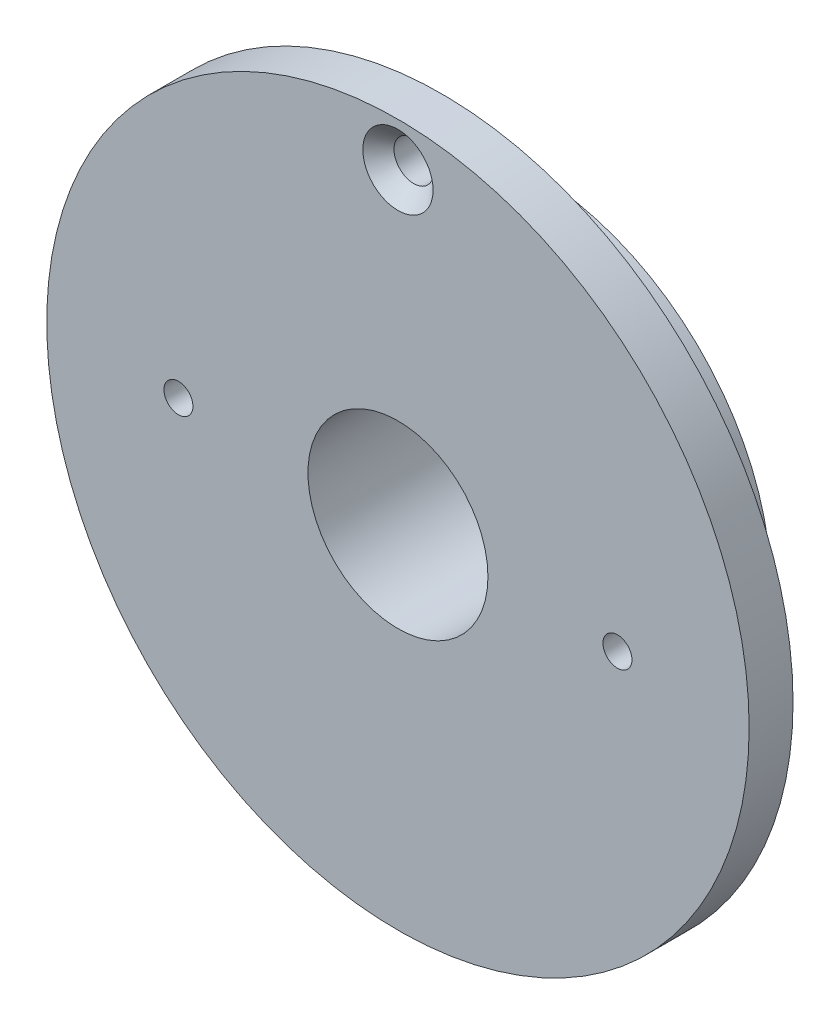
ISO-10303-21;
HEADER;
FILE_DESCRIPTION(('STEP AP214'),'2;1');
FILE_NAME('part.step','',(''),(''),'','','');
FILE_SCHEMA(('AUTOMOTIVE_DESIGN { 1 0 10303 214 1 1 1 1 }'));
ENDSEC;
DATA;
#1=APPLICATION_CONTEXT('core data for automotive mechanical design processes');
#2=APPLICATION_PROTOCOL_DEFINITION('international standard','automotive_design',2000,#1);
#3=PRODUCT_CONTEXT('',#1,'mechanical');
#4=PRODUCT('Part','Part','',(#3));
#5=PRODUCT_RELATED_PRODUCT_CATEGORY('part','',(#4));
#6=PRODUCT_DEFINITION_FORMATION('','',#4);
#7=PRODUCT_DEFINITION_CONTEXT('part definition',#1,'design');
#8=PRODUCT_DEFINITION('design','',#6,#7);
#9=PRODUCT_DEFINITION_SHAPE('','',#8);
#10=(LENGTH_UNIT() NAMED_UNIT(*) SI_UNIT(.MILLI.,.METRE.));
#11=(NAMED_UNIT(*) PLANE_ANGLE_UNIT() SI_UNIT($,.RADIAN.));
#12=(NAMED_UNIT(*) SI_UNIT($,.STERADIAN.) SOLID_ANGLE_UNIT());
#13=UNCERTAINTY_MEASURE_WITH_UNIT(LENGTH_MEASURE(1.E-05),#10,'distance_accuracy_value','');
#14=(GEOMETRIC_REPRESENTATION_CONTEXT(3) GLOBAL_UNCERTAINTY_ASSIGNED_CONTEXT((#13)) GLOBAL_UNIT_ASSIGNED_CONTEXT((#10,
#11,#12)) REPRESENTATION_CONTEXT('',''));
#15=CARTESIAN_POINT('',(0.,0.,0.));
#16=DIRECTION('',(0.,0.,1.));
#17=DIRECTION('',(1.,0.,0.));
#18=AXIS2_PLACEMENT_3D('',#15,#16,#17);
#19=CARTESIAN_POINT('',(0.,0.,0.));
#20=DIRECTION('',(0.,0.,1.));
#21=DIRECTION('',(1.,0.,0.));
#22=AXIS2_PLACEMENT_3D('',#19,#20,#21);
#23=PLANE('',#22);
#24=CARTESIAN_POINT('',(0.,35.,0.));
#25=DIRECTION('',(0.,0.,1.));
#26=DIRECTION('',(1.,0.,0.));
#27=AXIS2_PLACEMENT_3D('',#24,#25,#26);
#28=CIRCLE('',#27,2.25000000000001);
#29=CARTESIAN_POINT('',(2.25000000000001,35.,0.));
#30=VERTEX_POINT('',#29);
#31=EDGE_CURVE('E55',#30,#30,#28,.T.);
#32=ORIENTED_EDGE('',*,*,#31,.T.);
#33=EDGE_LOOP('',(#32));
#34=FACE_BOUND('',#33,.T.);
#35=CARTESIAN_POINT('',(0.,0.,0.));
#36=DIRECTION('',(0.,0.,1.));
#37=DIRECTION('',(1.,0.,0.));
#38=AXIS2_PLACEMENT_3D('',#35,#36,#37);
#39=CIRCLE('',#38,40.);
#40=CARTESIAN_POINT('',(40.,0.,0.));
#41=VERTEX_POINT('',#40);
#42=EDGE_CURVE('E44',#41,#41,#39,.T.);
#43=ORIENTED_EDGE('',*,*,#42,.F.);
#44=EDGE_LOOP('',(#43));
#45=FACE_BOUND('',#44,.T.);
#46=CARTESIAN_POINT('',(0.,0.,0.));
#47=DIRECTION('',(0.,0.,1.));
#48=DIRECTION('',(1.,0.,0.));
#49=AXIS2_PLACEMENT_3D('',#46,#47,#48);
#50=CIRCLE('',#49,27.5);
#51=CARTESIAN_POINT('',(27.5,0.,0.));
#52=VERTEX_POINT('',#51);
#53=EDGE_CURVE('E10',#52,#52,#50,.F.);
#54=ORIENTED_EDGE('',*,*,#53,.F.);
#55=EDGE_LOOP('',(#54));
#56=FACE_BOUND('',#55,.T.);
#57=ADVANCED_FACE('F32',(#34,#45,#56),#23,.F.);
#58=CARTESIAN_POINT('',(0.,0.,5.));
#59=DIRECTION('',(0.,0.,1.));
#60=DIRECTION('',(1.,0.,0.));
#61=AXIS2_PLACEMENT_3D('',#58,#59,#60);
#62=PLANE('',#61);
#63=CARTESIAN_POINT('',(0.,0.,5.));
#64=DIRECTION('',(0.,0.,1.));
#65=DIRECTION('',(1.,0.,0.));
#66=AXIS2_PLACEMENT_3D('',#63,#64,#65);
#67=CIRCLE('',#66,10.25);
#68=CARTESIAN_POINT('',(10.25,0.,5.));
#69=VERTEX_POINT('',#68);
#70=EDGE_CURVE('E73',#69,#69,#67,.T.);
#71=ORIENTED_EDGE('',*,*,#70,.F.);
#72=EDGE_LOOP('',(#71));
#73=FACE_BOUND('',#72,.T.);
#74=CARTESIAN_POINT('',(-25.,0.,5.));
#75=DIRECTION('',(0.,0.,1.));
#76=DIRECTION('',(1.,0.,0.));
#77=AXIS2_PLACEMENT_3D('',#74,#75,#76);
#78=CIRCLE('',#77,1.64999999999999);
#79=CARTESIAN_POINT('',(-23.35,0.,5.));
#80=VERTEX_POINT('',#79);
#81=EDGE_CURVE('E70',#80,#80,#78,.T.);
#82=ORIENTED_EDGE('',*,*,#81,.F.);
#83=EDGE_LOOP('',(#82));
#84=FACE_BOUND('',#83,.T.);
#85=CARTESIAN_POINT('',(25.,0.,5.));
#86=DIRECTION('',(0.,0.,1.));
#87=DIRECTION('',(1.,0.,0.));
#88=AXIS2_PLACEMENT_3D('',#85,#86,#87);
#89=CIRCLE('',#88,1.64999999999999);
#90=CARTESIAN_POINT('',(26.65,0.,5.));
#91=VERTEX_POINT('',#90);
#92=EDGE_CURVE('E64',#91,#91,#89,.T.);
#93=ORIENTED_EDGE('',*,*,#92,.F.);
#94=EDGE_LOOP('',(#93));
#95=FACE_BOUND('',#94,.T.);
#96=CARTESIAN_POINT('',(0.,0.,5.));
#97=DIRECTION('',(0.,0.,1.));
#98=DIRECTION('',(1.,0.,0.));
#99=AXIS2_PLACEMENT_3D('',#96,#97,#98);
#100=CIRCLE('',#99,40.);
#101=CARTESIAN_POINT('',(40.,0.,5.));
#102=VERTEX_POINT('',#101);
#103=EDGE_CURVE('E40',#102,#102,#100,.T.);
#104=ORIENTED_EDGE('',*,*,#103,.T.);
#105=EDGE_LOOP('',(#104));
#106=FACE_BOUND('',#105,.T.);
#107=CARTESIAN_POINT('',(0.,35.,5.));
#108=DIRECTION('',(0.,0.,1.));
#109=DIRECTION('',(1.,0.,0.));
#110=AXIS2_PLACEMENT_3D('',#107,#108,#109);
#111=CIRCLE('',#110,4.);
#112=CARTESIAN_POINT('',(4.,35.,5.));
#113=VERTEX_POINT('',#112);
#114=EDGE_CURVE('E48',#113,#113,#111,.T.);
#115=ORIENTED_EDGE('',*,*,#114,.F.);
#116=EDGE_LOOP('',(#115));
#117=FACE_BOUND('',#116,.T.);
#118=ADVANCED_FACE('F104',(#73,#84,#95,#106,#117),#62,.T.);
#119=CARTESIAN_POINT('',(0.,0.,5.));
#120=DIRECTION('',(0.,0.,-1.));
#121=DIRECTION('',(-1.,0.,0.));
#122=AXIS2_PLACEMENT_3D('',#119,#120,#121);
#123=CYLINDRICAL_SURFACE('',#122,40.);
#124=ORIENTED_EDGE('',*,*,#103,.F.);
#125=EDGE_LOOP('',(#124));
#126=FACE_BOUND('',#125,.T.);
#127=ORIENTED_EDGE('',*,*,#42,.T.);
#128=EDGE_LOOP('',(#127));
#129=FACE_BOUND('',#128,.T.);
#130=ADVANCED_FACE('F34',(#126,#129),#123,.T.);
#131=CARTESIAN_POINT('',(0.,35.,3.2));
#132=DIRECTION('',(0.,0.,1.));
#133=DIRECTION('',(1.,0.,0.));
#134=AXIS2_PLACEMENT_3D('',#131,#132,#133);
#135=CONICAL_SURFACE('',#134,2.25,0.771314587574589);
#136=ORIENTED_EDGE('',*,*,#114,.T.);
#137=EDGE_LOOP('',(#136));
#138=FACE_BOUND('',#137,.T.);
#139=CARTESIAN_POINT('',(0.,35.,3.2));
#140=DIRECTION('',(0.,0.,1.));
#141=DIRECTION('',(1.,0.,0.));
#142=AXIS2_PLACEMENT_3D('',#139,#140,#141);
#143=CIRCLE('',#142,2.25);
#144=CARTESIAN_POINT('',(2.25,35.,3.2));
#145=VERTEX_POINT('',#144);
#146=EDGE_CURVE('E52',#145,#145,#143,.T.);
#147=ORIENTED_EDGE('',*,*,#146,.F.);
#148=EDGE_LOOP('',(#147));
#149=FACE_BOUND('',#148,.T.);
#150=ADVANCED_FACE('F100',(#138,#149),#135,.F.);
#151=CARTESIAN_POINT('',(0.,35.,20.62283944233));
#152=DIRECTION('',(0.,0.,1.));
#153=DIRECTION('',(1.,0.,0.));
#154=AXIS2_PLACEMENT_3D('',#151,#152,#153);
#155=CYLINDRICAL_SURFACE('',#154,2.25000000000001);
#156=ORIENTED_EDGE('',*,*,#146,.T.);
#157=EDGE_LOOP('',(#156));
#158=FACE_BOUND('',#157,.T.);
#159=ORIENTED_EDGE('',*,*,#31,.F.);
#160=EDGE_LOOP('',(#159));
#161=FACE_BOUND('',#160,.T.);
#162=ADVANCED_FACE('F95',(#158,#161),#155,.F.);
#163=CARTESIAN_POINT('',(0.,0.,-10.));
#164=DIRECTION('',(0.,0.,1.));
#165=DIRECTION('',(1.,0.,0.));
#166=AXIS2_PLACEMENT_3D('',#163,#164,#165);
#167=CYLINDRICAL_SURFACE('',#166,27.5);
#168=CARTESIAN_POINT('',(0.,0.,-10.));
#169=DIRECTION('',(0.,0.,-1.));
#170=DIRECTION('',(-1.,0.,0.));
#171=AXIS2_PLACEMENT_3D('',#168,#169,#170);
#172=CIRCLE('',#171,27.5);
#173=CARTESIAN_POINT('',(-27.5,0.,-10.));
#174=VERTEX_POINT('',#173);
#175=EDGE_CURVE('E58',#174,#174,#172,.T.);
#176=ORIENTED_EDGE('',*,*,#175,.F.);
#177=EDGE_LOOP('',(#176));
#178=FACE_BOUND('',#177,.T.);
#179=ORIENTED_EDGE('',*,*,#53,.T.);
#180=EDGE_LOOP('',(#179));
#181=FACE_BOUND('',#180,.T.);
#182=ADVANCED_FACE('F86',(#178,#181),#167,.T.);
#183=CARTESIAN_POINT('',(0.,0.,-10.));
#184=DIRECTION('',(0.,0.,-1.));
#185=DIRECTION('',(-1.,0.,0.));
#186=AXIS2_PLACEMENT_3D('',#183,#184,#185);
#187=PLANE('',#186);
#188=CARTESIAN_POINT('',(0.,0.,-10.));
#189=DIRECTION('',(0.,0.,-1.));
#190=DIRECTION('',(-1.,0.,0.));
#191=AXIS2_PLACEMENT_3D('',#188,#189,#190);
#192=CIRCLE('',#191,10.25);
#193=CARTESIAN_POINT('',(-10.25,0.,-10.));
#194=VERTEX_POINT('',#193);
#195=EDGE_CURVE('E36',#194,#194,#192,.T.);
#196=ORIENTED_EDGE('',*,*,#195,.F.);
#197=EDGE_LOOP('',(#196));
#198=FACE_BOUND('',#197,.T.);
#199=CARTESIAN_POINT('',(-25.,0.,-10.));
#200=DIRECTION('',(0.,0.,1.));
#201=DIRECTION('',(1.,0.,0.));
#202=AXIS2_PLACEMENT_3D('',#199,#200,#201);
#203=CIRCLE('',#202,1.65);
#204=CARTESIAN_POINT('',(-23.35,0.,-10.));
#205=VERTEX_POINT('',#204);
#206=EDGE_CURVE('E67',#205,#205,#203,.T.);
#207=ORIENTED_EDGE('',*,*,#206,.T.);
#208=EDGE_LOOP('',(#207));
#209=FACE_BOUND('',#208,.T.);
#210=CARTESIAN_POINT('',(25.,0.,-10.));
#211=DIRECTION('',(0.,0.,1.));
#212=DIRECTION('',(1.,0.,0.));
#213=AXIS2_PLACEMENT_3D('',#210,#211,#212);
#214=CIRCLE('',#213,1.65);
#215=CARTESIAN_POINT('',(26.65,0.,-10.));
#216=VERTEX_POINT('',#215);
#217=EDGE_CURVE('E61',#216,#216,#214,.T.);
#218=ORIENTED_EDGE('',*,*,#217,.T.);
#219=EDGE_LOOP('',(#218));
#220=FACE_BOUND('',#219,.T.);
#221=ORIENTED_EDGE('',*,*,#175,.T.);
#222=EDGE_LOOP('',(#221));
#223=FACE_BOUND('',#222,.T.);
#224=ADVANCED_FACE('F82',(#198,#209,#220,#223),#187,.T.);
#225=CARTESIAN_POINT('',(25.,0.,5.));
#226=DIRECTION('',(0.,0.,1.));
#227=DIRECTION('',(1.,0.,0.));
#228=AXIS2_PLACEMENT_3D('',#225,#226,#227);
#229=CYLINDRICAL_SURFACE('',#228,1.64999999999999);
#230=ORIENTED_EDGE('',*,*,#217,.F.);
#231=EDGE_LOOP('',(#230));
#232=FACE_BOUND('',#231,.T.);
#233=ORIENTED_EDGE('',*,*,#92,.T.);
#234=EDGE_LOOP('',(#233));
#235=FACE_BOUND('',#234,.T.);
#236=ADVANCED_FACE('F85',(#232,#235),#229,.F.);
#237=CARTESIAN_POINT('',(-25.,0.,5.));
#238=DIRECTION('',(0.,0.,1.));
#239=DIRECTION('',(1.,0.,0.));
#240=AXIS2_PLACEMENT_3D('',#237,#238,#239);
#241=CYLINDRICAL_SURFACE('',#240,1.64999999999999);
#242=ORIENTED_EDGE('',*,*,#206,.F.);
#243=EDGE_LOOP('',(#242));
#244=FACE_BOUND('',#243,.T.);
#245=ORIENTED_EDGE('',*,*,#81,.T.);
#246=EDGE_LOOP('',(#245));
#247=FACE_BOUND('',#246,.T.);
#248=ADVANCED_FACE('F143',(#244,#247),#241,.F.);
#249=CARTESIAN_POINT('',(0.,0.,-29.8));
#250=DIRECTION('',(0.,0.,1.));
#251=DIRECTION('',(1.,0.,0.));
#252=AXIS2_PLACEMENT_3D('',#249,#250,#251);
#253=CYLINDRICAL_SURFACE('',#252,10.25);
#254=ORIENTED_EDGE('',*,*,#195,.T.);
#255=EDGE_LOOP('',(#254));
#256=FACE_BOUND('',#255,.T.);
#257=ORIENTED_EDGE('',*,*,#70,.T.);
#258=EDGE_LOOP('',(#257));
#259=FACE_BOUND('',#258,.T.);
#260=ADVANCED_FACE('F80',(#256,#259),#253,.F.);
#261=CLOSED_SHELL('',(#57,#118,#130,#150,#162,#182,#224,#236,#248,#260));
#262=MANIFOLD_SOLID_BREP('B2',#261);
#263=ADVANCED_BREP_SHAPE_REPRESENTATION('',(#18,#262),#14);
#264=SHAPE_DEFINITION_REPRESENTATION(#9,#263);
ENDSEC;
END-ISO-10303-21;
